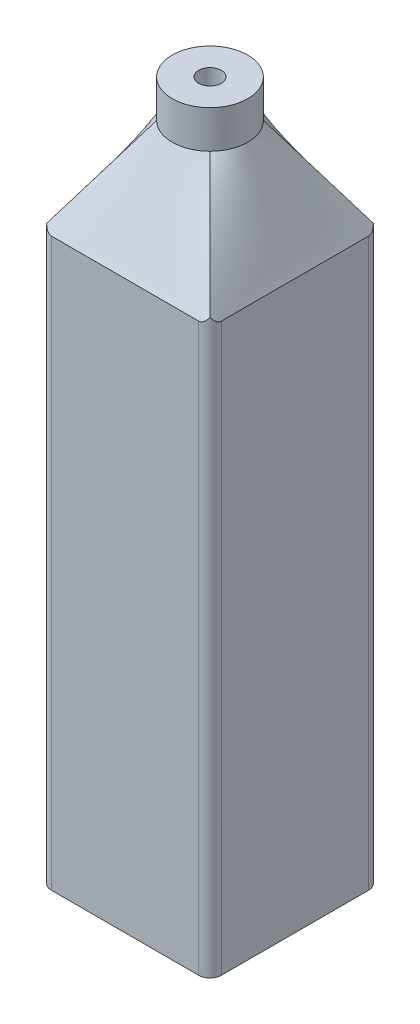
ISO-10303-21;
HEADER;
FILE_DESCRIPTION(('STEP AP214'),'2;1');
FILE_NAME('part.step','',(''),(''),'','','');
FILE_SCHEMA(('AUTOMOTIVE_DESIGN { 1 0 10303 214 1 1 1 1 }'));
ENDSEC;
DATA;
#1=APPLICATION_CONTEXT('core data for automotive mechanical design processes');
#2=APPLICATION_PROTOCOL_DEFINITION('international standard','automotive_design',2000,#1);
#3=PRODUCT_CONTEXT('',#1,'mechanical');
#4=PRODUCT('Part','Part','',(#3));
#5=PRODUCT_RELATED_PRODUCT_CATEGORY('part','',(#4));
#6=PRODUCT_DEFINITION_FORMATION('','',#4);
#7=PRODUCT_DEFINITION_CONTEXT('part definition',#1,'design');
#8=PRODUCT_DEFINITION('design','',#6,#7);
#9=PRODUCT_DEFINITION_SHAPE('','',#8);
#10=(LENGTH_UNIT() NAMED_UNIT(*) SI_UNIT(.MILLI.,.METRE.));
#11=(NAMED_UNIT(*) PLANE_ANGLE_UNIT() SI_UNIT($,.RADIAN.));
#12=(NAMED_UNIT(*) SI_UNIT($,.STERADIAN.) SOLID_ANGLE_UNIT());
#13=UNCERTAINTY_MEASURE_WITH_UNIT(LENGTH_MEASURE(1.E-05),#10,'distance_accuracy_value','');
#14=(GEOMETRIC_REPRESENTATION_CONTEXT(3) GLOBAL_UNCERTAINTY_ASSIGNED_CONTEXT((#13)) GLOBAL_UNIT_ASSIGNED_CONTEXT((#10,
#11,#12)) REPRESENTATION_CONTEXT('',''));
#15=CARTESIAN_POINT('',(0.,0.,0.));
#16=DIRECTION('',(0.,0.,1.));
#17=DIRECTION('',(1.,0.,0.));
#18=AXIS2_PLACEMENT_3D('',#15,#16,#17);
#19=CARTESIAN_POINT('',(22.5,150.,-22.5));
#20=DIRECTION('',(-1.,0.,0.));
#21=DIRECTION('',(0.,0.,1.));
#22=AXIS2_PLACEMENT_3D('',#19,#20,#21);
#23=PLANE('',#22);
#24=DIRECTION('',(0.,0.,-1.));
#25=VECTOR('',#24,1.);
#26=CARTESIAN_POINT('',(22.5,0.,-22.5));
#27=LINE('',#26,#25);
#28=CARTESIAN_POINT('',(22.5,0.,19.5));
#29=VERTEX_POINT('',#28);
#30=CARTESIAN_POINT('',(22.5,0.,-19.5));
#31=VERTEX_POINT('',#30);
#32=EDGE_CURVE('E331',#29,#31,#27,.T.);
#33=ORIENTED_EDGE('',*,*,#32,.T.);
#34=DIRECTION('',(0.,-1.,0.));
#35=VECTOR('',#34,1.);
#36=CARTESIAN_POINT('',(22.5,150.,-19.5));
#37=LINE('',#36,#35);
#38=CARTESIAN_POINT('',(22.5,150.,-19.5));
#39=VERTEX_POINT('',#38);
#40=EDGE_CURVE('E229',#31,#39,#37,.F.);
#41=ORIENTED_EDGE('',*,*,#40,.T.);
#42=DIRECTION('',(0.,0.,1.));
#43=VECTOR('',#42,1.);
#44=CARTESIAN_POINT('',(22.5,150.,-22.5));
#45=LINE('',#44,#43);
#46=CARTESIAN_POINT('',(22.5,150.,19.5));
#47=VERTEX_POINT('',#46);
#48=EDGE_CURVE('E329',#47,#39,#45,.F.);
#49=ORIENTED_EDGE('',*,*,#48,.F.);
#50=DIRECTION('',(0.,-1.,0.));
#51=VECTOR('',#50,1.);
#52=CARTESIAN_POINT('',(22.5,150.,19.5));
#53=LINE('',#52,#51);
#54=EDGE_CURVE('E226',#47,#29,#53,.T.);
#55=ORIENTED_EDGE('',*,*,#54,.T.);
#56=EDGE_LOOP('',(#33,#41,#49,#55));
#57=FACE_BOUND('',#56,.T.);
#58=ADVANCED_FACE('F67',(#57),#23,.F.);
#59=CARTESIAN_POINT('',(-22.5,150.,-22.5));
#60=DIRECTION('',(0.,0.,1.));
#61=DIRECTION('',(1.,0.,0.));
#62=AXIS2_PLACEMENT_3D('',#59,#60,#61);
#63=PLANE('',#62);
#64=DIRECTION('',(1.,0.,0.));
#65=VECTOR('',#64,1.);
#66=CARTESIAN_POINT('',(-22.5,150.,-22.5));
#67=LINE('',#66,#65);
#68=CARTESIAN_POINT('',(19.5,150.,-22.5));
#69=VERTEX_POINT('',#68);
#70=CARTESIAN_POINT('',(-19.5,150.,-22.5));
#71=VERTEX_POINT('',#70);
#72=EDGE_CURVE('E337',#69,#71,#67,.F.);
#73=ORIENTED_EDGE('',*,*,#72,.F.);
#74=DIRECTION('',(0.,-1.,0.));
#75=VECTOR('',#74,1.);
#76=CARTESIAN_POINT('',(19.5,150.,-22.5));
#77=LINE('',#76,#75);
#78=CARTESIAN_POINT('',(19.5,0.,-22.5));
#79=VERTEX_POINT('',#78);
#80=EDGE_CURVE('E214',#69,#79,#77,.T.);
#81=ORIENTED_EDGE('',*,*,#80,.T.);
#82=DIRECTION('',(-1.,0.,0.));
#83=VECTOR('',#82,1.);
#84=CARTESIAN_POINT('',(-22.5,0.,-22.5));
#85=LINE('',#84,#83);
#86=CARTESIAN_POINT('',(-19.5,0.,-22.5));
#87=VERTEX_POINT('',#86);
#88=EDGE_CURVE('E326',#79,#87,#85,.T.);
#89=ORIENTED_EDGE('',*,*,#88,.T.);
#90=DIRECTION('',(0.,-1.,0.));
#91=VECTOR('',#90,1.);
#92=CARTESIAN_POINT('',(-19.5,150.,-22.5));
#93=LINE('',#92,#91);
#94=EDGE_CURVE('E212',#87,#71,#93,.F.);
#95=ORIENTED_EDGE('',*,*,#94,.T.);
#96=EDGE_LOOP('',(#73,#81,#89,#95));
#97=FACE_BOUND('',#96,.T.);
#98=ADVANCED_FACE('F416',(#97),#63,.F.);
#99=CARTESIAN_POINT('',(-22.5,150.,-22.5));
#100=DIRECTION('',(1.,0.,0.));
#101=DIRECTION('',(0.,0.,-1.));
#102=AXIS2_PLACEMENT_3D('',#99,#100,#101);
#103=PLANE('',#102);
#104=DIRECTION('',(0.,0.,-1.));
#105=VECTOR('',#104,1.);
#106=CARTESIAN_POINT('',(-22.5,150.,-22.5));
#107=LINE('',#106,#105);
#108=CARTESIAN_POINT('',(-22.5,150.,-19.5));
#109=VERTEX_POINT('',#108);
#110=CARTESIAN_POINT('',(-22.5,150.,19.5));
#111=VERTEX_POINT('',#110);
#112=EDGE_CURVE('E319',#109,#111,#107,.F.);
#113=ORIENTED_EDGE('',*,*,#112,.F.);
#114=DIRECTION('',(0.,-1.,0.));
#115=VECTOR('',#114,1.);
#116=CARTESIAN_POINT('',(-22.5,150.,-19.5));
#117=LINE('',#116,#115);
#118=CARTESIAN_POINT('',(-22.5,0.,-19.5));
#119=VERTEX_POINT('',#118);
#120=EDGE_CURVE('E313',#109,#119,#117,.T.);
#121=ORIENTED_EDGE('',*,*,#120,.T.);
#122=DIRECTION('',(0.,0.,1.));
#123=VECTOR('',#122,1.);
#124=CARTESIAN_POINT('',(-22.5,0.,-22.5));
#125=LINE('',#124,#123);
#126=CARTESIAN_POINT('',(-22.5,0.,19.5));
#127=VERTEX_POINT('',#126);
#128=EDGE_CURVE('E318',#119,#127,#125,.T.);
#129=ORIENTED_EDGE('',*,*,#128,.T.);
#130=DIRECTION('',(0.,-1.,0.));
#131=VECTOR('',#130,1.);
#132=CARTESIAN_POINT('',(-22.5,150.,19.5));
#133=LINE('',#132,#131);
#134=EDGE_CURVE('E88',#127,#111,#133,.F.);
#135=ORIENTED_EDGE('',*,*,#134,.T.);
#136=EDGE_LOOP('',(#113,#121,#129,#135));
#137=FACE_BOUND('',#136,.T.);
#138=ADVANCED_FACE('F317',(#137),#103,.F.);
#139=CARTESIAN_POINT('',(-22.5,150.,22.5));
#140=DIRECTION('',(0.,0.,-1.));
#141=DIRECTION('',(-1.,0.,0.));
#142=AXIS2_PLACEMENT_3D('',#139,#140,#141);
#143=PLANE('',#142);
#144=DIRECTION('',(1.,0.,0.));
#145=VECTOR('',#144,1.);
#146=CARTESIAN_POINT('',(-22.5,0.,22.5));
#147=LINE('',#146,#145);
#148=CARTESIAN_POINT('',(-19.5,0.,22.5));
#149=VERTEX_POINT('',#148);
#150=CARTESIAN_POINT('',(19.5,0.,22.5));
#151=VERTEX_POINT('',#150);
#152=EDGE_CURVE('E325',#149,#151,#147,.T.);
#153=ORIENTED_EDGE('',*,*,#152,.T.);
#154=DIRECTION('',(0.,-1.,0.));
#155=VECTOR('',#154,1.);
#156=CARTESIAN_POINT('',(19.5,150.,22.5));
#157=LINE('',#156,#155);
#158=CARTESIAN_POINT('',(19.5,150.,22.5));
#159=VERTEX_POINT('',#158);
#160=EDGE_CURVE('E261',#151,#159,#157,.F.);
#161=ORIENTED_EDGE('',*,*,#160,.T.);
#162=DIRECTION('',(-1.,0.,0.));
#163=VECTOR('',#162,1.);
#164=CARTESIAN_POINT('',(-22.5,150.,22.5));
#165=LINE('',#164,#163);
#166=CARTESIAN_POINT('',(-19.5,150.,22.5));
#167=VERTEX_POINT('',#166);
#168=EDGE_CURVE('E215',#167,#159,#165,.F.);
#169=ORIENTED_EDGE('',*,*,#168,.F.);
#170=DIRECTION('',(0.,-1.,0.));
#171=VECTOR('',#170,1.);
#172=CARTESIAN_POINT('',(-19.5,150.,22.5));
#173=LINE('',#172,#171);
#174=EDGE_CURVE('E259',#167,#149,#173,.T.);
#175=ORIENTED_EDGE('',*,*,#174,.T.);
#176=EDGE_LOOP('',(#153,#161,#169,#175));
#177=FACE_BOUND('',#176,.T.);
#178=ADVANCED_FACE('F432',(#177),#143,.F.);
#179=CARTESIAN_POINT('',(0.,0.,0.));
#180=DIRECTION('',(0.,1.,0.));
#181=DIRECTION('',(0.,0.,1.));
#182=AXIS2_PLACEMENT_3D('',#179,#180,#181);
#183=PLANE('',#182);
#184=ORIENTED_EDGE('',*,*,#88,.F.);
#185=CARTESIAN_POINT('',(19.5,0.,-19.5));
#186=DIRECTION('',(0.,1.,0.));
#187=DIRECTION('',(0.,0.,1.));
#188=AXIS2_PLACEMENT_3D('',#185,#186,#187);
#189=CIRCLE('',#188,3.);
#190=EDGE_CURVE('E224',#79,#31,#189,.F.);
#191=ORIENTED_EDGE('',*,*,#190,.T.);
#192=ORIENTED_EDGE('',*,*,#32,.F.);
#193=CARTESIAN_POINT('',(19.5,0.,19.5));
#194=DIRECTION('',(0.,1.,0.));
#195=DIRECTION('',(0.,0.,1.));
#196=AXIS2_PLACEMENT_3D('',#193,#194,#195);
#197=CIRCLE('',#196,3.);
#198=EDGE_CURVE('E222',#29,#151,#197,.F.);
#199=ORIENTED_EDGE('',*,*,#198,.T.);
#200=ORIENTED_EDGE('',*,*,#152,.F.);
#201=CARTESIAN_POINT('',(-19.5,0.,19.5));
#202=DIRECTION('',(0.,1.,0.));
#203=DIRECTION('',(0.,0.,1.));
#204=AXIS2_PLACEMENT_3D('',#201,#202,#203);
#205=CIRCLE('',#204,3.);
#206=EDGE_CURVE('E218',#149,#127,#205,.F.);
#207=ORIENTED_EDGE('',*,*,#206,.T.);
#208=ORIENTED_EDGE('',*,*,#128,.F.);
#209=CARTESIAN_POINT('',(-19.5,0.,-19.5));
#210=DIRECTION('',(0.,1.,0.));
#211=DIRECTION('',(0.,0.,1.));
#212=AXIS2_PLACEMENT_3D('',#209,#210,#211);
#213=CIRCLE('',#212,3.);
#214=EDGE_CURVE('E220',#119,#87,#213,.F.);
#215=ORIENTED_EDGE('',*,*,#214,.T.);
#216=EDGE_LOOP('',(#184,#191,#192,#199,#200,#207,#208,#215));
#217=FACE_BOUND('',#216,.T.);
#218=ADVANCED_FACE('F279',(#217),#183,.F.);
#219=CARTESIAN_POINT('',(7.07106781186548,175.,7.07106781186548));
#220=CARTESIAN_POINT('',(22.5,150.,22.5));
#221=CARTESIAN_POINT('',(6.65440114519881,175.,7.48773447853214));
#222=CARTESIAN_POINT('',(20.625,150.,22.5));
#223=CARTESIAN_POINT('',(6.18511190982561,175.,7.88294229636119));
#224=CARTESIAN_POINT('',(18.75,150.,22.5));
#225=CARTESIAN_POINT('',(5.14757980414371,175.,8.59644174904935));
#226=CARTESIAN_POINT('',(15.,150.,22.5));
#227=CARTESIAN_POINT('',(4.57928394964498,175.,8.91450237104858));
#228=CARTESIAN_POINT('',(13.125,150.,22.5));
#229=CARTESIAN_POINT('',(3.36426300033644,175.,9.44033518893657));
#230=CARTESIAN_POINT('',(9.37499999999998,150.,22.5));
#231=CARTESIAN_POINT('',(2.71763303055414,175.,9.64784964914938));
#232=CARTESIAN_POINT('',(7.49999999999998,150.,22.5));
#233=CARTESIAN_POINT('',(1.380556458553,175.,9.92776893395985));
#234=CARTESIAN_POINT('',(3.74999999999998,150.,22.5));
#235=CARTESIAN_POINT('',(0.690355937288491,175.,10.));
#236=CARTESIAN_POINT('',(1.87499999999999,150.,22.5));
#237=CARTESIAN_POINT('',(-0.690355937288492,175.,10.));
#238=CARTESIAN_POINT('',(-1.87500000000001,150.,22.5));
#239=CARTESIAN_POINT('',(-1.380556458553,175.,9.92776893395986));
#240=CARTESIAN_POINT('',(-3.75000000000001,150.,22.5));
#241=CARTESIAN_POINT('',(-2.71763303055414,175.,9.64784964914939));
#242=CARTESIAN_POINT('',(-7.50000000000001,150.,22.5));
#243=CARTESIAN_POINT('',(-3.36426300033644,175.,9.44033518893656));
#244=CARTESIAN_POINT('',(-9.37500000000001,150.,22.5));
#245=CARTESIAN_POINT('',(-4.57928394964498,175.,8.91450237104857));
#246=CARTESIAN_POINT('',(-13.125,150.,22.5));
#247=CARTESIAN_POINT('',(-5.14757980414371,175.,8.59644174904935));
#248=CARTESIAN_POINT('',(-15.,150.,22.5));
#249=CARTESIAN_POINT('',(-6.18511190982561,175.,7.88294229636119));
#250=CARTESIAN_POINT('',(-18.75,150.,22.5));
#251=CARTESIAN_POINT('',(-6.65440114519881,175.,7.48773447853214));
#252=CARTESIAN_POINT('',(-20.625,150.,22.5));
#253=CARTESIAN_POINT('',(-7.07106781186548,175.,7.07106781186547));
#254=CARTESIAN_POINT('',(-22.5,150.,22.5));
#255=B_SPLINE_SURFACE_WITH_KNOTS('',3,1,((#219,#220),(#221,#222),(#223,#224),(#225,#226),(#227,
#228),(#229,#230),(#231,#232),(#233,#234),(#235,#236),(#237,#238),(#239,#240),(#241,#242),(#243,
#244),(#245,#246),(#247,#248),(#249,#250),(#251,#252),(#253,#254)),.UNSPECIFIED.,.F.,.F.,.F.,(4,
2,2,2,2,2,2,2,4),(2,2),(0.,0.125,0.25,0.375,0.5,0.625,0.75,0.875,1.),(0.,1.),.UNSPECIFIED.);
#256=CARTESIAN_POINT('',(19.5,150.,22.5));
#257=CARTESIAN_POINT('',(19.5467401688951,149.999984005418,22.5000094138974));
#258=CARTESIAN_POINT('',(19.5934679038539,150.001846764079,22.4989079800952));
#259=CARTESIAN_POINT('',(19.6864873407841,150.009182169151,22.4945572194069));
#260=CARTESIAN_POINT('',(19.7327794740498,150.014650753205,22.4913103096256));
#261=CARTESIAN_POINT('',(19.8241183622581,150.028971636876,22.482789202402));
#262=CARTESIAN_POINT('',(19.8691732139651,150.037786070103,22.477537688309));
#263=CARTESIAN_POINT('',(19.9582830670935,150.05856893091,22.4651314178803));
#264=CARTESIAN_POINT('',(20.0023377290657,150.070538412389,22.4579760255745));
#265=CARTESIAN_POINT('',(20.1539604817051,150.117386179754,22.4299156884908));
#266=CARTESIAN_POINT('',(20.2584185762058,150.159836574012,22.4044028097067));
#267=CARTESIAN_POINT('',(20.4582494010697,150.258535692636,22.3447755613622));
#268=CARTESIAN_POINT('',(20.5535754777791,150.314850516002,22.3106199650893));
#269=CARTESIAN_POINT('',(20.7142016926202,150.42358610398,22.2443491753437));
#270=CARTESIAN_POINT('',(20.7814200170454,150.474012569751,22.2135161517834));
#271=CARTESIAN_POINT('',(20.9104749125336,150.579587974537,22.1487316692483));
#272=CARTESIAN_POINT('',(20.9723080436447,150.634739888098,22.1147782450712));
#273=CARTESIAN_POINT('',(21.0909896531621,150.748803099198,22.0443115224689));
#274=CARTESIAN_POINT('',(21.1478310120924,150.807719565593,22.007794697322));
#275=CARTESIAN_POINT('',(21.2567973919136,150.92846213905,21.9327017790263));
#276=CARTESIAN_POINT('',(21.308923969352,150.990287275516,21.8941263722384));
#277=CARTESIAN_POINT('',(21.4065047518526,151.11333591329,21.8170940517066));
#278=CARTESIAN_POINT('',(21.4521568615924,151.174452713781,21.7787157083737));
#279=CARTESIAN_POINT('',(21.5395264899447,151.298075808234,21.7008450226262));
#280=CARTESIAN_POINT('',(21.5812656600243,151.360571760214,21.6613606010007));
#281=CARTESIAN_POINT('',(21.6213203435596,151.423753189343,21.6213203435597));
#282=B_SPLINE_CURVE_WITH_KNOTS('',3,(#256,#257,#258,#259,#260,#261,#262,#263,#264,#265,#266,
#267,#268,#269,#270,#271,#272,#273,#274,#275,#276,#277,#278,#279,#280,#281),.UNSPECIFIED.,.F.,
.F.,(4,2,2,2,2,2,2,2,2,2,2,2,4),(0.,0.140150553512958,0.280143481255936,0.418597133224973,
0.557097092329758,0.901837763486269,1.24825495025312,1.51641367067605,1.78474244793817,
2.0534479139143,2.32206434262544,2.57813828705465,2.83269939449287),.UNSPECIFIED.);
#283=CARTESIAN_POINT('',(21.6213203435596,151.423753189343,21.6213203435596));
#284=VERTEX_POINT('',#283);
#285=EDGE_CURVE('E260',#159,#284,#282,.T.);
#286=DIRECTION('',(-0.464966560557573,0.753400421506732,-0.464966560557573));
#287=VECTOR('',#286,1.);
#288=CARTESIAN_POINT('',(14.7855339059327,162.5,14.7855339059327));
#289=LINE('',#288,#287);
#290=CARTESIAN_POINT('',(7.07106781186548,175.,7.07106781186548));
#291=VERTEX_POINT('',#290);
#292=EDGE_CURVE('E172',#284,#291,#289,.T.);
#293=CARTESIAN_POINT('',(0.,175.,0.));
#294=DIRECTION('',(0.,1.,0.));
#295=DIRECTION('',(0.,0.,1.));
#296=AXIS2_PLACEMENT_3D('',#293,#294,#295);
#297=CIRCLE('',#296,10.);
#298=CARTESIAN_POINT('',(-7.07106781186548,175.,7.07106781186547));
#299=VERTEX_POINT('',#298);
#300=EDGE_CURVE('E173',#299,#291,#297,.T.);
#301=DIRECTION('',(-0.464966560557573,-0.753400421506732,0.464966560557573));
#302=VECTOR('',#301,1.);
#303=CARTESIAN_POINT('',(-14.7855339059327,162.5,14.7855339059327));
#304=LINE('',#303,#302);
#305=CARTESIAN_POINT('',(-21.6213203435596,151.423753189343,21.6213203435596));
#306=VERTEX_POINT('',#305);
#307=EDGE_CURVE('E167',#299,#306,#304,.T.);
#308=CARTESIAN_POINT('',(-21.6213203435596,151.423753189343,21.6213203435596));
#309=CARTESIAN_POINT('',(-21.5916909054333,151.377004301653,21.6509462261797));
#310=CARTESIAN_POINT('',(-21.561140297291,151.330645210572,21.6802592468402));
#311=CARTESIAN_POINT('',(-21.498076390994,151.238811533732,21.7381974838398));
#312=CARTESIAN_POINT('',(-21.4655623941791,151.193337270534,21.7668224502126));
#313=CARTESIAN_POINT('',(-21.3644800653313,151.057849439403,21.8519171571821));
#314=CARTESIAN_POINT('',(-21.2927635761293,150.96939784035,21.9072094615045));
#315=CARTESIAN_POINT('',(-21.1382656439737,150.796196556373,22.014989605267));
#316=CARTESIAN_POINT('',(-21.0552648026056,150.711581672198,22.0673817208301));
#317=CARTESIAN_POINT('',(-20.8785796814253,150.550900828306,22.1664081778634));
#318=CARTESIAN_POINT('',(-20.7849301104597,150.474808612867,22.2130602490017));
#319=CARTESIAN_POINT('',(-20.6442550607155,150.375662884577,22.2735690955763));
#320=CARTESIAN_POINT('',(-20.6020601071454,150.347654650752,22.2906260825088));
#321=CARTESIAN_POINT('',(-20.5156254180582,150.294009474847,22.3232324850938));
#322=CARTESIAN_POINT('',(-20.4713854438199,150.268372810662,22.3387817240828));
#323=CARTESIAN_POINT('',(-20.3360212363078,150.195801862028,22.382711941606));
#324=CARTESIAN_POINT('',(-20.2418078071072,150.15288526755,22.4085712574718));
#325=CARTESIAN_POINT('',(-20.0589226575057,150.085969309775,22.4487557710398));
#326=CARTESIAN_POINT('',(-19.9711388651399,150.060229447098,22.4641474432054));
#327=CARTESIAN_POINT('',(-19.8367428586965,150.031331816407,22.4813844252622));
#328=CARTESIAN_POINT('',(-19.7915100803049,150.023319276023,22.4861542330762));
#329=CARTESIAN_POINT('',(-19.7004124608053,150.010718394369,22.4936461165292));
#330=CARTESIAN_POINT('',(-19.6545480509635,150.006127824259,22.4963695250634));
#331=CARTESIAN_POINT('',(-19.5904824957589,150.002212996958,22.4986898846736));
#332=CARTESIAN_POINT('',(-19.5723922682164,150.001383520716,22.4991811336982));
#333=CARTESIAN_POINT('',(-19.5362021998498,150.000277246933,22.4998360559896));
#334=CARTESIAN_POINT('',(-19.5181023756137,150.000000047449,22.4999999674909));
#335=CARTESIAN_POINT('',(-19.5,150.,22.5));
#336=B_SPLINE_CURVE_WITH_KNOTS('',3,(#308,#309,#310,#311,#312,#313,#314,#315,#316,#317,#318,
#319,#320,#321,#322,#323,#324,#325,#326,#327,#328,#329,#330,#331,#332,#333,#334,#335),
.UNSPECIFIED.,.F.,.F.,(4,2,2,2,2,2,2,2,2,2,2,2,2,4),(0.,0.188315108059321,0.376697626383373,
0.755974969840869,1.14411498729407,1.53102431420725,1.69124550455335,1.85148544544682,
2.17023143230005,2.4472700997661,2.58567495172128,2.72398957717124,2.77832835311382,
2.83262756714457),.UNSPECIFIED.);
#337=EDGE_CURVE('E253',#306,#167,#336,.T.);
#338=ORIENTED_EDGE('',*,*,#168,.T.);
#339=ORIENTED_EDGE('',*,*,#285,.T.);
#340=ORIENTED_EDGE('',*,*,#292,.T.);
#341=ORIENTED_EDGE('',*,*,#300,.F.);
#342=ORIENTED_EDGE('',*,*,#307,.T.);
#343=ORIENTED_EDGE('',*,*,#337,.T.);
#344=EDGE_LOOP('',(#338,#339,#340,#341,#342,#343));
#345=FACE_BOUND('',#344,.T.);
#346=ADVANCED_FACE('F252',(#345),#255,.T.);
#347=CARTESIAN_POINT('',(-7.07106781186548,175.,7.07106781186547));
#348=CARTESIAN_POINT('',(-22.5,150.,22.5));
#349=CARTESIAN_POINT('',(-7.48773447853215,175.,6.65440114519881));
#350=CARTESIAN_POINT('',(-22.5,150.,20.625));
#351=CARTESIAN_POINT('',(-7.88294229636119,175.,6.1851119098256));
#352=CARTESIAN_POINT('',(-22.5,150.,18.75));
#353=CARTESIAN_POINT('',(-8.59644174904935,175.,5.1475798041437));
#354=CARTESIAN_POINT('',(-22.5,150.,15.));
#355=CARTESIAN_POINT('',(-8.91450237104858,175.,4.57928394964497));
#356=CARTESIAN_POINT('',(-22.5,150.,13.125));
#357=CARTESIAN_POINT('',(-9.44033518893657,175.,3.36426300033644));
#358=CARTESIAN_POINT('',(-22.5,150.,9.37499999999999));
#359=CARTESIAN_POINT('',(-9.64784964914938,175.,2.71763303055414));
#360=CARTESIAN_POINT('',(-22.5,150.,7.49999999999999));
#361=CARTESIAN_POINT('',(-9.92776893395986,175.,1.38055645855299));
#362=CARTESIAN_POINT('',(-22.5,150.,3.74999999999999));
#363=CARTESIAN_POINT('',(-10.,175.,0.69035593728849));
#364=CARTESIAN_POINT('',(-22.5,150.,1.87499999999999));
#365=CARTESIAN_POINT('',(-10.,175.,-0.690355937288494));
#366=CARTESIAN_POINT('',(-22.5,150.,-1.87500000000001));
#367=CARTESIAN_POINT('',(-9.92776893395986,175.,-1.380556458553));
#368=CARTESIAN_POINT('',(-22.5,150.,-3.75000000000001));
#369=CARTESIAN_POINT('',(-9.64784964914938,175.,-2.71763303055414));
#370=CARTESIAN_POINT('',(-22.5,150.,-7.5));
#371=CARTESIAN_POINT('',(-9.44033518893657,175.,-3.36426300033644));
#372=CARTESIAN_POINT('',(-22.5,150.,-9.375));
#373=CARTESIAN_POINT('',(-8.91450237104857,175.,-4.57928394964498));
#374=CARTESIAN_POINT('',(-22.5,150.,-13.125));
#375=CARTESIAN_POINT('',(-8.59644174904935,175.,-5.1475798041437));
#376=CARTESIAN_POINT('',(-22.5,150.,-15.));
#377=CARTESIAN_POINT('',(-7.88294229636119,175.,-6.18511190982561));
#378=CARTESIAN_POINT('',(-22.5,150.,-18.75));
#379=CARTESIAN_POINT('',(-7.48773447853214,175.,-6.65440114519881));
#380=CARTESIAN_POINT('',(-22.5,150.,-20.625));
#381=CARTESIAN_POINT('',(-7.07106781186547,175.,-7.07106781186548));
#382=CARTESIAN_POINT('',(-22.5,150.,-22.5));
#383=B_SPLINE_SURFACE_WITH_KNOTS('',3,1,((#347,#348),(#349,#350),(#351,#352),(#353,#354),(#355,
#356),(#357,#358),(#359,#360),(#361,#362),(#363,#364),(#365,#366),(#367,#368),(#369,#370),(#371,
#372),(#373,#374),(#375,#376),(#377,#378),(#379,#380),(#381,#382)),.UNSPECIFIED.,.F.,.F.,.F.,(4,
2,2,2,2,2,2,2,4),(2,2),(0.,0.125,0.25,0.375,0.5,0.625,0.75,0.875,1.),(0.,1.),.UNSPECIFIED.);
#384=DIRECTION('',(-0.464966560557573,-0.753400421506732,-0.464966560557573));
#385=VECTOR('',#384,1.);
#386=CARTESIAN_POINT('',(-14.7855339059327,162.5,-14.7855339059327));
#387=LINE('',#386,#385);
#388=CARTESIAN_POINT('',(-7.07106781186548,175.,-7.07106781186548));
#389=VERTEX_POINT('',#388);
#390=CARTESIAN_POINT('',(-21.6213203435596,151.423753189343,-21.6213203435596));
#391=VERTEX_POINT('',#390);
#392=EDGE_CURVE('E165',#389,#391,#387,.T.);
#393=CARTESIAN_POINT('',(-21.6213203435596,151.423753189343,-21.6213203435596));
#394=CARTESIAN_POINT('',(-21.6509462261797,151.377004301653,-21.5916909054333));
#395=CARTESIAN_POINT('',(-21.6802592468403,151.330645210572,-21.561140297291));
#396=CARTESIAN_POINT('',(-21.7381974838398,151.238811533732,-21.498076390994));
#397=CARTESIAN_POINT('',(-21.7668224502126,151.193337270534,-21.4655623941791));
#398=CARTESIAN_POINT('',(-21.8519171571821,151.057849439403,-21.3644800653313));
#399=CARTESIAN_POINT('',(-21.9072094615045,150.96939784035,-21.2927635761293));
#400=CARTESIAN_POINT('',(-22.014989605267,150.796196556373,-21.1382656439737));
#401=CARTESIAN_POINT('',(-22.0673817208301,150.711581672198,-21.0552648026056));
#402=CARTESIAN_POINT('',(-22.1664081778634,150.550900828306,-20.8785796814253));
#403=CARTESIAN_POINT('',(-22.2130602490017,150.474808612867,-20.7849301104597));
#404=CARTESIAN_POINT('',(-22.2735690955763,150.375662884577,-20.6442550607154));
#405=CARTESIAN_POINT('',(-22.2906260825088,150.347654650752,-20.6020601071453));
#406=CARTESIAN_POINT('',(-22.3232324850938,150.294009474847,-20.5156254180581));
#407=CARTESIAN_POINT('',(-22.3387817240828,150.268372810662,-20.4713854438199));
#408=CARTESIAN_POINT('',(-22.382711941606,150.195801862028,-20.3360212363078));
#409=CARTESIAN_POINT('',(-22.4085712574718,150.15288526755,-20.2418078071072));
#410=CARTESIAN_POINT('',(-22.4487557710399,150.085969309775,-20.0589226575057));
#411=CARTESIAN_POINT('',(-22.4641474432054,150.060229447098,-19.9711388651399));
#412=CARTESIAN_POINT('',(-22.4813844252622,150.031331816407,-19.8367428586965));
#413=CARTESIAN_POINT('',(-22.4861542330762,150.023319276023,-19.7915100803049));
#414=CARTESIAN_POINT('',(-22.4936461165292,150.010718394369,-19.7004124608052));
#415=CARTESIAN_POINT('',(-22.4963695250634,150.006127824259,-19.6545480509635));
#416=CARTESIAN_POINT('',(-22.4986898846736,150.002212996958,-19.5904824957588));
#417=CARTESIAN_POINT('',(-22.4991811336982,150.001383520716,-19.5723922682164));
#418=CARTESIAN_POINT('',(-22.4998360559896,150.000277246933,-19.5362021998498));
#419=CARTESIAN_POINT('',(-22.4999999674909,150.000000047449,-19.5181023756137));
#420=CARTESIAN_POINT('',(-22.5,150.,-19.5));
#421=B_SPLINE_CURVE_WITH_KNOTS('',3,(#393,#394,#395,#396,#397,#398,#399,#400,#401,#402,#403,
#404,#405,#406,#407,#408,#409,#410,#411,#412,#413,#414,#415,#416,#417,#418,#419,#420),
.UNSPECIFIED.,.F.,.F.,(4,2,2,2,2,2,2,2,2,2,2,2,2,4),(0.,0.188315108059328,0.37669762638338,
0.755974969840848,1.14411498729409,1.53102431420729,1.69124550455341,1.85148544544686,
2.1702314323001,2.44727009976615,2.58567495172132,2.72398957717128,2.77832835311385,
2.83262756714459),.UNSPECIFIED.);
#422=EDGE_CURVE('E12',#391,#109,#421,.T.);
#423=CARTESIAN_POINT('',(-22.5,150.,19.5));
#424=CARTESIAN_POINT('',(-22.5000094138974,149.999984005418,19.5467401688951));
#425=CARTESIAN_POINT('',(-22.4989079800952,150.001846764079,19.5934679038539));
#426=CARTESIAN_POINT('',(-22.494557219407,150.009182169151,19.686487340784));
#427=CARTESIAN_POINT('',(-22.4913103096256,150.014650753205,19.7327794740498));
#428=CARTESIAN_POINT('',(-22.482789202402,150.028971636876,19.8241183622581));
#429=CARTESIAN_POINT('',(-22.477537688309,150.037786070103,19.869173213965));
#430=CARTESIAN_POINT('',(-22.4651314178803,150.05856893091,19.9582830670935));
#431=CARTESIAN_POINT('',(-22.4579760255746,150.070538412388,20.0023377290656));
#432=CARTESIAN_POINT('',(-22.4299156884908,150.117386179754,20.1539604817051));
#433=CARTESIAN_POINT('',(-22.4044028097067,150.159836574012,20.2584185762058));
#434=CARTESIAN_POINT('',(-22.3447755613622,150.258535692636,20.4582494010697));
#435=CARTESIAN_POINT('',(-22.3106199650893,150.314850516002,20.5535754777791));
#436=CARTESIAN_POINT('',(-22.2443491753437,150.42358610398,20.7142016926202));
#437=CARTESIAN_POINT('',(-22.2135161517835,150.474012569751,20.7814200170453));
#438=CARTESIAN_POINT('',(-22.1487316692483,150.579587974537,20.9104749125335));
#439=CARTESIAN_POINT('',(-22.1147782450712,150.634739888098,20.9723080436447));
#440=CARTESIAN_POINT('',(-22.0443115224689,150.748803099198,21.0909896531621));
#441=CARTESIAN_POINT('',(-22.0077946973221,150.807719565593,21.1478310120924));
#442=CARTESIAN_POINT('',(-21.9327017790264,150.92846213905,21.2567973919135));
#443=CARTESIAN_POINT('',(-21.8941263722385,150.990287275516,21.308923969352));
#444=CARTESIAN_POINT('',(-21.8170940517066,151.11333591329,21.4065047518525));
#445=CARTESIAN_POINT('',(-21.7787157083737,151.174452713781,21.4521568615924));
#446=CARTESIAN_POINT('',(-21.7008450226263,151.298075808234,21.5395264899446));
#447=CARTESIAN_POINT('',(-21.6613606010007,151.360571760214,21.5812656600243));
#448=CARTESIAN_POINT('',(-21.6213203435597,151.423753189343,21.6213203435596));
#449=B_SPLINE_CURVE_WITH_KNOTS('',3,(#423,#424,#425,#426,#427,#428,#429,#430,#431,#432,#433,
#434,#435,#436,#437,#438,#439,#440,#441,#442,#443,#444,#445,#446,#447,#448),.UNSPECIFIED.,.F.,
.F.,(4,2,2,2,2,2,2,2,2,2,2,2,4),(0.,0.140150553512952,0.280143481255926,0.418597133224944,
0.557097092329728,0.901837763486223,1.24825495025308,1.51641367067598,1.78474244793807,
2.0534479139142,2.32206434262529,2.57813828705459,2.83269939449291),.UNSPECIFIED.);
#450=EDGE_CURVE('E81',#111,#306,#449,.T.);
#451=EDGE_CURVE('E161',#389,#299,#297,.T.);
#452=ORIENTED_EDGE('',*,*,#392,.T.);
#453=ORIENTED_EDGE('',*,*,#422,.T.);
#454=ORIENTED_EDGE('',*,*,#112,.T.);
#455=ORIENTED_EDGE('',*,*,#450,.T.);
#456=ORIENTED_EDGE('',*,*,#307,.F.);
#457=ORIENTED_EDGE('',*,*,#451,.F.);
#458=EDGE_LOOP('',(#452,#453,#454,#455,#456,#457));
#459=FACE_BOUND('',#458,.T.);
#460=ADVANCED_FACE('F164',(#459),#383,.T.);
#461=CARTESIAN_POINT('',(7.07106781186548,175.,-7.07106781186547));
#462=CARTESIAN_POINT('',(22.5,150.,-22.5));
#463=CARTESIAN_POINT('',(7.48773447853214,175.,-6.65440114519881));
#464=CARTESIAN_POINT('',(22.5,150.,-20.625));
#465=CARTESIAN_POINT('',(7.88294229636119,175.,-6.1851119098256));
#466=CARTESIAN_POINT('',(22.5,150.,-18.75));
#467=CARTESIAN_POINT('',(8.59644174904935,175.,-5.1475798041437));
#468=CARTESIAN_POINT('',(22.5,150.,-15.));
#469=CARTESIAN_POINT('',(8.91450237104858,175.,-4.57928394964498));
#470=CARTESIAN_POINT('',(22.5,150.,-13.125));
#471=CARTESIAN_POINT('',(9.44033518893657,175.,-3.36426300033644));
#472=CARTESIAN_POINT('',(22.5,150.,-9.37499999999999));
#473=CARTESIAN_POINT('',(9.64784964914938,175.,-2.71763303055414));
#474=CARTESIAN_POINT('',(22.5,150.,-7.49999999999999));
#475=CARTESIAN_POINT('',(9.92776893395986,175.,-1.380556458553));
#476=CARTESIAN_POINT('',(22.5,150.,-3.74999999999999));
#477=CARTESIAN_POINT('',(10.,175.,-0.690355937288491));
#478=CARTESIAN_POINT('',(22.5,150.,-1.87499999999999));
#479=CARTESIAN_POINT('',(10.,175.,0.690355937288493));
#480=CARTESIAN_POINT('',(22.5,150.,1.87500000000001));
#481=CARTESIAN_POINT('',(9.92776893395985,175.,1.380556458553));
#482=CARTESIAN_POINT('',(22.5,150.,3.75000000000001));
#483=CARTESIAN_POINT('',(9.64784964914939,175.,2.71763303055414));
#484=CARTESIAN_POINT('',(22.5,150.,7.50000000000001));
#485=CARTESIAN_POINT('',(9.44033518893657,175.,3.36426300033644));
#486=CARTESIAN_POINT('',(22.5,150.,9.37500000000001));
#487=CARTESIAN_POINT('',(8.91450237104857,175.,4.57928394964498));
#488=CARTESIAN_POINT('',(22.5,150.,13.125));
#489=CARTESIAN_POINT('',(8.59644174904935,175.,5.14757980414371));
#490=CARTESIAN_POINT('',(22.5,150.,15.));
#491=CARTESIAN_POINT('',(7.88294229636119,175.,6.18511190982561));
#492=CARTESIAN_POINT('',(22.5,150.,18.75));
#493=CARTESIAN_POINT('',(7.48773447853214,175.,6.65440114519881));
#494=CARTESIAN_POINT('',(22.5,150.,20.625));
#495=CARTESIAN_POINT('',(7.07106781186548,175.,7.07106781186548));
#496=CARTESIAN_POINT('',(22.5,150.,22.5));
#497=B_SPLINE_SURFACE_WITH_KNOTS('',3,1,((#461,#462),(#463,#464),(#465,#466),(#467,#468),(#469,
#470),(#471,#472),(#473,#474),(#475,#476),(#477,#478),(#479,#480),(#481,#482),(#483,#484),(#485,
#486),(#487,#488),(#489,#490),(#491,#492),(#493,#494),(#495,#496)),.UNSPECIFIED.,.F.,.F.,.F.,(4,
2,2,2,2,2,2,2,4),(2,2),(0.,0.125,0.25,0.375,0.5,0.625,0.75,0.875,1.),(0.,1.),.UNSPECIFIED.);
#498=CARTESIAN_POINT('',(22.5,150.,-19.5));
#499=CARTESIAN_POINT('',(22.5000094138974,149.999984005418,-19.5467401688951));
#500=CARTESIAN_POINT('',(22.4989079800952,150.001846764079,-19.5934679038539));
#501=CARTESIAN_POINT('',(22.4945572194069,150.009182169151,-19.6864873407841));
#502=CARTESIAN_POINT('',(22.4913103096256,150.014650753205,-19.7327794740498));
#503=CARTESIAN_POINT('',(22.482789202402,150.028971636876,-19.8241183622581));
#504=CARTESIAN_POINT('',(22.477537688309,150.037786070103,-19.8691732139651));
#505=CARTESIAN_POINT('',(22.4651314178803,150.058568930911,-19.9582830670935));
#506=CARTESIAN_POINT('',(22.4579760255745,150.070538412389,-20.0023377290657));
#507=CARTESIAN_POINT('',(22.4299156884908,150.117386179754,-20.1539604817051));
#508=CARTESIAN_POINT('',(22.4044028097067,150.159836574012,-20.2584185762058));
#509=CARTESIAN_POINT('',(22.3447755613622,150.258535692636,-20.4582494010697));
#510=CARTESIAN_POINT('',(22.3106199650892,150.314850516002,-20.5535754777791));
#511=CARTESIAN_POINT('',(22.2443491753437,150.42358610398,-20.7142016926202));
#512=CARTESIAN_POINT('',(22.2135161517834,150.474012569751,-20.7814200170454));
#513=CARTESIAN_POINT('',(22.1487316692483,150.579587974537,-20.9104749125335));
#514=CARTESIAN_POINT('',(22.1147782450712,150.634739888098,-20.9723080436447));
#515=CARTESIAN_POINT('',(22.0443115224689,150.748803099198,-21.0909896531621));
#516=CARTESIAN_POINT('',(22.007794697322,150.807719565593,-21.1478310120924));
#517=CARTESIAN_POINT('',(21.9327017790263,150.92846213905,-21.2567973919136));
#518=CARTESIAN_POINT('',(21.8941263722385,150.990287275516,-21.308923969352));
#519=CARTESIAN_POINT('',(21.8170940517066,151.11333591329,-21.4065047518526));
#520=CARTESIAN_POINT('',(21.7787157083737,151.174452713781,-21.4521568615924));
#521=CARTESIAN_POINT('',(21.7008450226262,151.298075808234,-21.5395264899447));
#522=CARTESIAN_POINT('',(21.6613606010007,151.360571760214,-21.5812656600243));
#523=CARTESIAN_POINT('',(21.6213203435596,151.423753189343,-21.6213203435596));
#524=B_SPLINE_CURVE_WITH_KNOTS('',3,(#498,#499,#500,#501,#502,#503,#504,#505,#506,#507,#508,
#509,#510,#511,#512,#513,#514,#515,#516,#517,#518,#519,#520,#521,#522,#523),.UNSPECIFIED.,.F.,
.F.,(4,2,2,2,2,2,2,2,2,2,2,2,4),(0.,0.14015055351296,0.280143481255938,0.418597133224976,
0.557097092329761,0.901837763486269,1.24825495025312,1.51641367067602,1.78474244793813,
2.05344791391427,2.32206434262536,2.57813828705461,2.83269939449289),.UNSPECIFIED.);
#525=CARTESIAN_POINT('',(21.6213203435596,151.423753189343,-21.6213203435596));
#526=VERTEX_POINT('',#525);
#527=EDGE_CURVE('E342',#39,#526,#524,.T.);
#528=DIRECTION('',(0.464966560557573,-0.753400421506732,-0.464966560557573));
#529=VECTOR('',#528,1.);
#530=CARTESIAN_POINT('',(14.7855339059327,162.5,-14.7855339059327));
#531=LINE('',#530,#529);
#532=CARTESIAN_POINT('',(7.07106781186548,175.,-7.07106781186547));
#533=VERTEX_POINT('',#532);
#534=EDGE_CURVE('E186',#533,#526,#531,.T.);
#535=EDGE_CURVE('E193',#291,#533,#297,.T.);
#536=CARTESIAN_POINT('',(21.6213203435596,151.423753189343,21.6213203435596));
#537=CARTESIAN_POINT('',(21.6509462261797,151.377004301653,21.5916909054333));
#538=CARTESIAN_POINT('',(21.6802592468403,151.330645210572,21.561140297291));
#539=CARTESIAN_POINT('',(21.7381974838398,151.238811533732,21.498076390994));
#540=CARTESIAN_POINT('',(21.7668224502126,151.193337270534,21.4655623941791));
#541=CARTESIAN_POINT('',(21.8519171571821,151.057849439403,21.3644800653312));
#542=CARTESIAN_POINT('',(21.9072094615045,150.96939784035,21.2927635761293));
#543=CARTESIAN_POINT('',(22.014989605267,150.796196556373,21.1382656439737));
#544=CARTESIAN_POINT('',(22.0673817208301,150.711581672198,21.0552648026056));
#545=CARTESIAN_POINT('',(22.1664081778634,150.550900828306,20.8785796814253));
#546=CARTESIAN_POINT('',(22.2130602490017,150.474808612867,20.7849301104597));
#547=CARTESIAN_POINT('',(22.2735690955763,150.375662884577,20.6442550607155));
#548=CARTESIAN_POINT('',(22.2906260825088,150.347654650752,20.6020601071454));
#549=CARTESIAN_POINT('',(22.3232324850938,150.294009474847,20.5156254180582));
#550=CARTESIAN_POINT('',(22.3387817240828,150.268372810662,20.4713854438199));
#551=CARTESIAN_POINT('',(22.382711941606,150.195801862028,20.3360212363078));
#552=CARTESIAN_POINT('',(22.4085712574718,150.15288526755,20.2418078071072));
#553=CARTESIAN_POINT('',(22.4487557710399,150.085969309775,20.0589226575057));
#554=CARTESIAN_POINT('',(22.4641474432054,150.060229447099,19.9711388651399));
#555=CARTESIAN_POINT('',(22.4813844252622,150.031331816407,19.8367428586965));
#556=CARTESIAN_POINT('',(22.4861542330762,150.023319276023,19.7915100803049));
#557=CARTESIAN_POINT('',(22.4936461165292,150.010718394369,19.7004124608053));
#558=CARTESIAN_POINT('',(22.4963695250634,150.006127824259,19.6545480509635));
#559=CARTESIAN_POINT('',(22.4986898846736,150.002212996958,19.5904824957588));
#560=CARTESIAN_POINT('',(22.4991811336982,150.001383520716,19.5723922682164));
#561=CARTESIAN_POINT('',(22.4998360559896,150.000277246933,19.5362021998498));
#562=CARTESIAN_POINT('',(22.4999999674909,150.000000047449,19.5181023756137));
#563=CARTESIAN_POINT('',(22.5,150.,19.5));
#564=B_SPLINE_CURVE_WITH_KNOTS('',3,(#536,#537,#538,#539,#540,#541,#542,#543,#544,#545,#546,
#547,#548,#549,#550,#551,#552,#553,#554,#555,#556,#557,#558,#559,#560,#561,#562,#563),
.UNSPECIFIED.,.F.,.F.,(4,2,2,2,2,2,2,2,2,2,2,2,2,4),(0.,0.188315108059341,0.376697626383415,
0.755974969840879,1.14411498729407,1.53102431420725,1.69124550455338,1.85148544544683,
2.17023143230007,2.44727009976611,2.58567495172129,2.72398957717126,2.77832835311383,
2.83262756714459),.UNSPECIFIED.);
#565=EDGE_CURVE('E231',#284,#47,#564,.T.);
#566=ORIENTED_EDGE('',*,*,#48,.T.);
#567=ORIENTED_EDGE('',*,*,#527,.T.);
#568=ORIENTED_EDGE('',*,*,#534,.F.);
#569=ORIENTED_EDGE('',*,*,#535,.F.);
#570=ORIENTED_EDGE('',*,*,#292,.F.);
#571=ORIENTED_EDGE('',*,*,#565,.T.);
#572=EDGE_LOOP('',(#566,#567,#568,#569,#570,#571));
#573=FACE_BOUND('',#572,.T.);
#574=ADVANCED_FACE('F293',(#573),#497,.T.);
#575=CARTESIAN_POINT('',(-7.07106781186547,175.,-7.07106781186548));
#576=CARTESIAN_POINT('',(-22.5,150.,-22.5));
#577=CARTESIAN_POINT('',(-6.65440114519881,175.,-7.48773447853214));
#578=CARTESIAN_POINT('',(-20.625,150.,-22.5));
#579=CARTESIAN_POINT('',(-6.1851119098256,175.,-7.8829422963612));
#580=CARTESIAN_POINT('',(-18.75,150.,-22.5));
#581=CARTESIAN_POINT('',(-5.1475798041437,175.,-8.59644174904935));
#582=CARTESIAN_POINT('',(-15.,150.,-22.5));
#583=CARTESIAN_POINT('',(-4.57928394964498,175.,-8.91450237104858));
#584=CARTESIAN_POINT('',(-13.125,150.,-22.5));
#585=CARTESIAN_POINT('',(-3.36426300033644,175.,-9.44033518893657));
#586=CARTESIAN_POINT('',(-9.37499999999999,150.,-22.5));
#587=CARTESIAN_POINT('',(-2.71763303055414,175.,-9.64784964914938));
#588=CARTESIAN_POINT('',(-7.49999999999999,150.,-22.5));
#589=CARTESIAN_POINT('',(-1.380556458553,175.,-9.92776893395986));
#590=CARTESIAN_POINT('',(-3.74999999999999,150.,-22.5));
#591=CARTESIAN_POINT('',(-0.690355937288491,175.,-10.));
#592=CARTESIAN_POINT('',(-1.87499999999999,150.,-22.5));
#593=CARTESIAN_POINT('',(0.690355937288493,175.,-10.));
#594=CARTESIAN_POINT('',(1.87500000000001,150.,-22.5));
#595=CARTESIAN_POINT('',(1.380556458553,175.,-9.92776893395986));
#596=CARTESIAN_POINT('',(3.75000000000001,150.,-22.5));
#597=CARTESIAN_POINT('',(2.71763303055414,175.,-9.64784964914939));
#598=CARTESIAN_POINT('',(7.50000000000001,150.,-22.5));
#599=CARTESIAN_POINT('',(3.36426300033644,175.,-9.44033518893656));
#600=CARTESIAN_POINT('',(9.37500000000001,150.,-22.5));
#601=CARTESIAN_POINT('',(4.57928394964498,175.,-8.91450237104857));
#602=CARTESIAN_POINT('',(13.125,150.,-22.5));
#603=CARTESIAN_POINT('',(5.14757980414371,175.,-8.59644174904935));
#604=CARTESIAN_POINT('',(15.,150.,-22.5));
#605=CARTESIAN_POINT('',(6.18511190982561,175.,-7.88294229636119));
#606=CARTESIAN_POINT('',(18.75,150.,-22.5));
#607=CARTESIAN_POINT('',(6.65440114519881,175.,-7.48773447853214));
#608=CARTESIAN_POINT('',(20.625,150.,-22.5));
#609=CARTESIAN_POINT('',(7.07106781186548,175.,-7.07106781186547));
#610=CARTESIAN_POINT('',(22.5,150.,-22.5));
#611=B_SPLINE_SURFACE_WITH_KNOTS('',3,1,((#575,#576),(#577,#578),(#579,#580),(#581,#582),(#583,
#584),(#585,#586),(#587,#588),(#589,#590),(#591,#592),(#593,#594),(#595,#596),(#597,#598),(#599,
#600),(#601,#602),(#603,#604),(#605,#606),(#607,#608),(#609,#610)),.UNSPECIFIED.,.F.,.F.,.F.,(4,
2,2,2,2,2,2,2,4),(2,2),(0.,0.125,0.25,0.375,0.5,0.625,0.75,0.875,1.),(0.,1.),.UNSPECIFIED.);
#612=CARTESIAN_POINT('',(21.6213203435596,151.423753189343,-21.6213203435596));
#613=CARTESIAN_POINT('',(21.5916909054333,151.377004301653,-21.6509462261797));
#614=CARTESIAN_POINT('',(21.561140297291,151.330645210572,-21.6802592468403));
#615=CARTESIAN_POINT('',(21.498076390994,151.238811533732,-21.7381974838398));
#616=CARTESIAN_POINT('',(21.4655623941791,151.193337270534,-21.7668224502126));
#617=CARTESIAN_POINT('',(21.3644800653313,151.057849439403,-21.8519171571821));
#618=CARTESIAN_POINT('',(21.2927635761293,150.96939784035,-21.9072094615045));
#619=CARTESIAN_POINT('',(21.1382656439737,150.796196556373,-22.014989605267));
#620=CARTESIAN_POINT('',(21.0552648026056,150.711581672198,-22.0673817208301));
#621=CARTESIAN_POINT('',(20.8785796814253,150.550900828306,-22.1664081778634));
#622=CARTESIAN_POINT('',(20.7849301104597,150.474808612867,-22.2130602490017));
#623=CARTESIAN_POINT('',(20.6442550607155,150.375662884577,-22.2735690955763));
#624=CARTESIAN_POINT('',(20.6020601071454,150.347654650752,-22.2906260825088));
#625=CARTESIAN_POINT('',(20.5156254180582,150.294009474847,-22.3232324850938));
#626=CARTESIAN_POINT('',(20.4713854438199,150.268372810662,-22.3387817240828));
#627=CARTESIAN_POINT('',(20.3360212363078,150.195801862028,-22.382711941606));
#628=CARTESIAN_POINT('',(20.2418078071072,150.15288526755,-22.4085712574718));
#629=CARTESIAN_POINT('',(20.0589226575057,150.085969309775,-22.4487557710399));
#630=CARTESIAN_POINT('',(19.9711388651399,150.060229447098,-22.4641474432054));
#631=CARTESIAN_POINT('',(19.8367428586965,150.031331816407,-22.4813844252622));
#632=CARTESIAN_POINT('',(19.7915100803049,150.023319276023,-22.4861542330762));
#633=CARTESIAN_POINT('',(19.7004124608052,150.010718394369,-22.4936461165292));
#634=CARTESIAN_POINT('',(19.6545480509635,150.006127824259,-22.4963695250634));
#635=CARTESIAN_POINT('',(19.5904824957588,150.002212996958,-22.4986898846736));
#636=CARTESIAN_POINT('',(19.5723922682164,150.001383520716,-22.4991811336982));
#637=CARTESIAN_POINT('',(19.5362021998498,150.000277246933,-22.4998360559896));
#638=CARTESIAN_POINT('',(19.5181023756137,150.000000047449,-22.4999999674909));
#639=CARTESIAN_POINT('',(19.5,150.,-22.5));
#640=B_SPLINE_CURVE_WITH_KNOTS('',3,(#612,#613,#614,#615,#616,#617,#618,#619,#620,#621,#622,
#623,#624,#625,#626,#627,#628,#629,#630,#631,#632,#633,#634,#635,#636,#637,#638,#639),
.UNSPECIFIED.,.F.,.F.,(4,2,2,2,2,2,2,2,2,2,2,2,2,4),(0.,0.188315108059328,0.376697626383368,
0.755974969840854,1.14411498729406,1.53102431420726,1.69124550455338,1.85148544544684,
2.17023143230009,2.44727009976613,2.58567495172131,2.72398957717128,2.77832835311384,
2.83262756714458),.UNSPECIFIED.);
#641=EDGE_CURVE('E352',#526,#69,#640,.T.);
#642=CARTESIAN_POINT('',(-19.5,150.,-22.5));
#643=CARTESIAN_POINT('',(-19.5467401688951,149.999984005418,-22.5000094138974));
#644=CARTESIAN_POINT('',(-19.5934679038539,150.001846764079,-22.4989079800952));
#645=CARTESIAN_POINT('',(-19.6864873407841,150.009182169151,-22.494557219407));
#646=CARTESIAN_POINT('',(-19.7327794740498,150.014650753205,-22.4913103096256));
#647=CARTESIAN_POINT('',(-19.8241183622581,150.028971636876,-22.482789202402));
#648=CARTESIAN_POINT('',(-19.8691732139651,150.037786070103,-22.477537688309));
#649=CARTESIAN_POINT('',(-19.9582830670935,150.05856893091,-22.4651314178803));
#650=CARTESIAN_POINT('',(-20.0023377290657,150.070538412389,-22.4579760255746));
#651=CARTESIAN_POINT('',(-20.1539604817051,150.117386179754,-22.4299156884908));
#652=CARTESIAN_POINT('',(-20.2584185762058,150.159836574012,-22.4044028097067));
#653=CARTESIAN_POINT('',(-20.4582494010697,150.258535692636,-22.3447755613622));
#654=CARTESIAN_POINT('',(-20.5535754777791,150.314850516002,-22.3106199650893));
#655=CARTESIAN_POINT('',(-20.7142016926202,150.42358610398,-22.2443491753437));
#656=CARTESIAN_POINT('',(-20.7814200170454,150.474012569751,-22.2135161517835));
#657=CARTESIAN_POINT('',(-20.9104749125335,150.579587974537,-22.1487316692483));
#658=CARTESIAN_POINT('',(-20.9723080436447,150.634739888098,-22.1147782450712));
#659=CARTESIAN_POINT('',(-21.0909896531621,150.748803099198,-22.0443115224689));
#660=CARTESIAN_POINT('',(-21.1478310120924,150.807719565593,-22.007794697322));
#661=CARTESIAN_POINT('',(-21.2567973919135,150.92846213905,-21.9327017790263));
#662=CARTESIAN_POINT('',(-21.308923969352,150.990287275516,-21.8941263722385));
#663=CARTESIAN_POINT('',(-21.4065047518525,151.11333591329,-21.8170940517066));
#664=CARTESIAN_POINT('',(-21.4521568615924,151.174452713781,-21.7787157083737));
#665=CARTESIAN_POINT('',(-21.5395264899446,151.298075808234,-21.7008450226263));
#666=CARTESIAN_POINT('',(-21.5812656600243,151.360571760214,-21.6613606010007));
#667=CARTESIAN_POINT('',(-21.6213203435596,151.423753189343,-21.6213203435597));
#668=B_SPLINE_CURVE_WITH_KNOTS('',3,(#642,#643,#644,#645,#646,#647,#648,#649,#650,#651,#652,
#653,#654,#655,#656,#657,#658,#659,#660,#661,#662,#663,#664,#665,#666,#667),.UNSPECIFIED.,.F.,
.F.,(4,2,2,2,2,2,2,2,2,2,2,2,4),(0.,0.140150553512958,0.280143481255939,0.418597133224975,
0.557097092329768,0.901837763486272,1.24825495025312,1.516413670676,1.7847424479381,
2.05344791391421,2.32206434262526,2.57813828705457,2.83269939449288),.UNSPECIFIED.);
#669=EDGE_CURVE('E185',#71,#391,#668,.T.);
#670=EDGE_CURVE('E180',#533,#389,#297,.T.);
#671=ORIENTED_EDGE('',*,*,#534,.T.);
#672=ORIENTED_EDGE('',*,*,#641,.T.);
#673=ORIENTED_EDGE('',*,*,#72,.T.);
#674=ORIENTED_EDGE('',*,*,#669,.T.);
#675=ORIENTED_EDGE('',*,*,#392,.F.);
#676=ORIENTED_EDGE('',*,*,#670,.F.);
#677=EDGE_LOOP('',(#671,#672,#673,#674,#675,#676));
#678=FACE_BOUND('',#677,.T.);
#679=ADVANCED_FACE('F179',(#678),#611,.T.);
#680=CARTESIAN_POINT('',(0.,185.,0.));
#681=DIRECTION('',(0.,-1.,0.));
#682=DIRECTION('',(0.,0.,-1.));
#683=AXIS2_PLACEMENT_3D('',#680,#681,#682);
#684=CYLINDRICAL_SURFACE('',#683,10.);
#685=ORIENTED_EDGE('',*,*,#535,.T.);
#686=ORIENTED_EDGE('',*,*,#670,.T.);
#687=ORIENTED_EDGE('',*,*,#451,.T.);
#688=ORIENTED_EDGE('',*,*,#300,.T.);
#689=EDGE_LOOP('',(#685,#686,#687,#688));
#690=FACE_BOUND('',#689,.T.);
#691=CARTESIAN_POINT('',(0.,185.,0.));
#692=DIRECTION('',(0.,1.,0.));
#693=DIRECTION('',(0.,0.,1.));
#694=AXIS2_PLACEMENT_3D('',#691,#692,#693);
#695=CIRCLE('',#694,10.);
#696=CARTESIAN_POINT('',(0.,185.,10.));
#697=VERTEX_POINT('',#696);
#698=EDGE_CURVE('E195',#697,#697,#695,.T.);
#699=ORIENTED_EDGE('',*,*,#698,.F.);
#700=EDGE_LOOP('',(#699));
#701=FACE_BOUND('',#700,.T.);
#702=ADVANCED_FACE('F190',(#690,#701),#684,.T.);
#703=CARTESIAN_POINT('',(0.,185.,0.));
#704=DIRECTION('',(0.,1.,0.));
#705=DIRECTION('',(0.,0.,1.));
#706=AXIS2_PLACEMENT_3D('',#703,#704,#705);
#707=PLANE('',#706);
#708=CARTESIAN_POINT('',(0.,185.,0.));
#709=DIRECTION('',(0.,1.,0.));
#710=DIRECTION('',(0.,0.,1.));
#711=AXIS2_PLACEMENT_3D('',#708,#709,#710);
#712=CIRCLE('',#711,3.);
#713=CARTESIAN_POINT('',(0.,185.,3.));
#714=VERTEX_POINT('',#713);
#715=EDGE_CURVE('E557',#714,#714,#712,.T.);
#716=ORIENTED_EDGE('',*,*,#715,.F.);
#717=EDGE_LOOP('',(#716));
#718=FACE_BOUND('',#717,.T.);
#719=ORIENTED_EDGE('',*,*,#698,.T.);
#720=EDGE_LOOP('',(#719));
#721=FACE_BOUND('',#720,.T.);
#722=ADVANCED_FACE('F465',(#718,#721),#707,.T.);
#723=CARTESIAN_POINT('',(0.,155.,0.));
#724=DIRECTION('',(0.,1.,0.));
#725=DIRECTION('',(0.,0.,1.));
#726=AXIS2_PLACEMENT_3D('',#723,#724,#725);
#727=CYLINDRICAL_SURFACE('',#726,3.);
#728=CARTESIAN_POINT('',(0.,155.,0.));
#729=DIRECTION('',(0.,1.,0.));
#730=DIRECTION('',(0.,0.,1.));
#731=AXIS2_PLACEMENT_3D('',#728,#729,#730);
#732=CIRCLE('',#731,3.);
#733=CARTESIAN_POINT('',(0.,155.,3.));
#734=VERTEX_POINT('',#733);
#735=EDGE_CURVE('E556',#734,#734,#732,.T.);
#736=ORIENTED_EDGE('',*,*,#735,.F.);
#737=EDGE_LOOP('',(#736));
#738=FACE_BOUND('',#737,.T.);
#739=ORIENTED_EDGE('',*,*,#715,.T.);
#740=EDGE_LOOP('',(#739));
#741=FACE_BOUND('',#740,.T.);
#742=ADVANCED_FACE('F471',(#738,#741),#727,.F.);
#743=CARTESIAN_POINT('',(0.,155.,0.));
#744=DIRECTION('',(0.,1.,0.));
#745=DIRECTION('',(0.,0.,1.));
#746=AXIS2_PLACEMENT_3D('',#743,#744,#745);
#747=PLANE('',#746);
#748=ORIENTED_EDGE('',*,*,#735,.T.);
#749=EDGE_LOOP('',(#748));
#750=FACE_BOUND('',#749,.T.);
#751=ADVANCED_FACE('F368',(#750),#747,.T.);
#752=CARTESIAN_POINT('',(19.5,150.,-19.5));
#753=DIRECTION('',(0.,-1.,0.));
#754=DIRECTION('',(0.,0.,-1.));
#755=AXIS2_PLACEMENT_3D('',#752,#753,#754);
#756=CYLINDRICAL_SURFACE('',#755,3.);
#757=ORIENTED_EDGE('',*,*,#527,.F.);
#758=ORIENTED_EDGE('',*,*,#40,.F.);
#759=ORIENTED_EDGE('',*,*,#190,.F.);
#760=ORIENTED_EDGE('',*,*,#80,.F.);
#761=ORIENTED_EDGE('',*,*,#641,.F.);
#762=EDGE_LOOP('',(#757,#758,#759,#760,#761));
#763=FACE_BOUND('',#762,.T.);
#764=ADVANCED_FACE('F350',(#763),#756,.T.);
#765=CARTESIAN_POINT('',(19.5,150.,19.5));
#766=DIRECTION('',(0.,-1.,0.));
#767=DIRECTION('',(0.,0.,-1.));
#768=AXIS2_PLACEMENT_3D('',#765,#766,#767);
#769=CYLINDRICAL_SURFACE('',#768,3.);
#770=ORIENTED_EDGE('',*,*,#285,.F.);
#771=ORIENTED_EDGE('',*,*,#160,.F.);
#772=ORIENTED_EDGE('',*,*,#198,.F.);
#773=ORIENTED_EDGE('',*,*,#54,.F.);
#774=ORIENTED_EDGE('',*,*,#565,.F.);
#775=EDGE_LOOP('',(#770,#771,#772,#773,#774));
#776=FACE_BOUND('',#775,.T.);
#777=ADVANCED_FACE('F367',(#776),#769,.T.);
#778=CARTESIAN_POINT('',(-19.5,150.,-19.5));
#779=DIRECTION('',(0.,-1.,0.));
#780=DIRECTION('',(0.,0.,-1.));
#781=AXIS2_PLACEMENT_3D('',#778,#779,#780);
#782=CYLINDRICAL_SURFACE('',#781,3.);
#783=ORIENTED_EDGE('',*,*,#669,.F.);
#784=ORIENTED_EDGE('',*,*,#94,.F.);
#785=ORIENTED_EDGE('',*,*,#214,.F.);
#786=ORIENTED_EDGE('',*,*,#120,.F.);
#787=ORIENTED_EDGE('',*,*,#422,.F.);
#788=EDGE_LOOP('',(#783,#784,#785,#786,#787));
#789=FACE_BOUND('',#788,.T.);
#790=ADVANCED_FACE('F418',(#789),#782,.T.);
#791=CARTESIAN_POINT('',(-19.5,150.,19.5));
#792=DIRECTION('',(0.,-1.,0.));
#793=DIRECTION('',(0.,0.,-1.));
#794=AXIS2_PLACEMENT_3D('',#791,#792,#793);
#795=CYLINDRICAL_SURFACE('',#794,3.);
#796=ORIENTED_EDGE('',*,*,#450,.F.);
#797=ORIENTED_EDGE('',*,*,#134,.F.);
#798=ORIENTED_EDGE('',*,*,#206,.F.);
#799=ORIENTED_EDGE('',*,*,#174,.F.);
#800=ORIENTED_EDGE('',*,*,#337,.F.);
#801=EDGE_LOOP('',(#796,#797,#798,#799,#800));
#802=FACE_BOUND('',#801,.T.);
#803=ADVANCED_FACE('F69',(#802),#795,.T.);
#804=CLOSED_SHELL('',(#58,#98,#138,#178,#218,#346,#460,#574,#679,#702,#722,#742,#751,#764,#777,
#790,#803));
#805=MANIFOLD_SOLID_BREP('B2',#804);
#806=ADVANCED_BREP_SHAPE_REPRESENTATION('',(#18,#805),#14);
#807=SHAPE_DEFINITION_REPRESENTATION(#9,#806);
ENDSEC;
END-ISO-10303-21;
